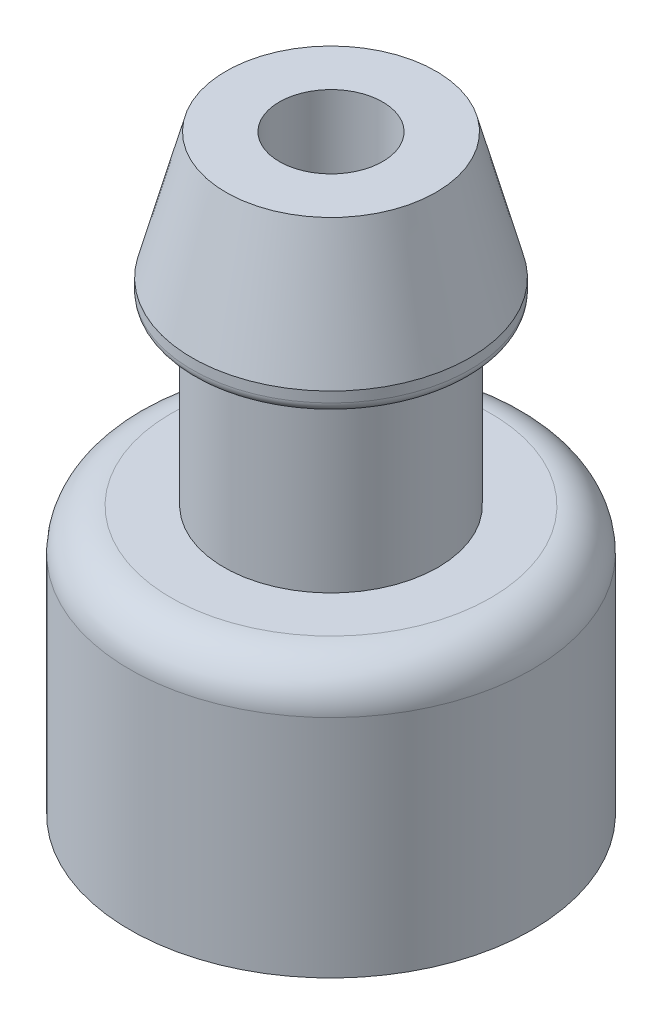
ISO-10303-21;
HEADER;
FILE_DESCRIPTION(('STEP AP214'),'2;1');
FILE_NAME('part.step','',(''),(''),'','','');
FILE_SCHEMA(('AUTOMOTIVE_DESIGN { 1 0 10303 214 1 1 1 1 }'));
ENDSEC;
DATA;
#1=APPLICATION_CONTEXT('core data for automotive mechanical design processes');
#2=APPLICATION_PROTOCOL_DEFINITION('international standard','automotive_design',2000,#1);
#3=PRODUCT_CONTEXT('',#1,'mechanical');
#4=PRODUCT('Part','Part','',(#3));
#5=PRODUCT_RELATED_PRODUCT_CATEGORY('part','',(#4));
#6=PRODUCT_DEFINITION_FORMATION('','',#4);
#7=PRODUCT_DEFINITION_CONTEXT('part definition',#1,'design');
#8=PRODUCT_DEFINITION('design','',#6,#7);
#9=PRODUCT_DEFINITION_SHAPE('','',#8);
#10=(LENGTH_UNIT() NAMED_UNIT(*) SI_UNIT(.MILLI.,.METRE.));
#11=(NAMED_UNIT(*) PLANE_ANGLE_UNIT() SI_UNIT($,.RADIAN.));
#12=(NAMED_UNIT(*) SI_UNIT($,.STERADIAN.) SOLID_ANGLE_UNIT());
#13=UNCERTAINTY_MEASURE_WITH_UNIT(LENGTH_MEASURE(1.E-05),#10,'distance_accuracy_value','');
#14=(GEOMETRIC_REPRESENTATION_CONTEXT(3) GLOBAL_UNCERTAINTY_ASSIGNED_CONTEXT((#13)) GLOBAL_UNIT_ASSIGNED_CONTEXT((#10,
#11,#12)) REPRESENTATION_CONTEXT('',''));
#15=CARTESIAN_POINT('',(0.,0.,0.));
#16=DIRECTION('',(0.,0.,1.));
#17=DIRECTION('',(1.,0.,0.));
#18=AXIS2_PLACEMENT_3D('',#15,#16,#17);
#19=CARTESIAN_POINT('',(2.5,25.1953317633222,0.));
#20=DIRECTION('',(0.,1.,0.));
#21=DIRECTION('',(-1.,0.,0.));
#22=AXIS2_PLACEMENT_3D('',#19,#20,#21);
#23=PLANE('',#22);
#24=CARTESIAN_POINT('',(0.,25.1953317633222,0.));
#25=DIRECTION('',(0.,1.,0.));
#26=DIRECTION('',(-1.,0.,0.));
#27=AXIS2_PLACEMENT_3D('',#24,#25,#26);
#28=CIRCLE('',#27,2.49999999999999);
#29=CARTESIAN_POINT('',(-2.49999999999998,25.1953317633222,0.));
#30=VERTEX_POINT('',#29);
#31=EDGE_CURVE('E157',#30,#30,#28,.F.);
#32=ORIENTED_EDGE('',*,*,#31,.T.);
#33=EDGE_LOOP('',(#32));
#34=FACE_BOUND('',#33,.T.);
#35=CARTESIAN_POINT('',(0.,25.1953317632569,0.));
#36=DIRECTION('',(0.,-1.,0.));
#37=DIRECTION('',(1.,0.,0.));
#38=AXIS2_PLACEMENT_3D('',#35,#36,#37);
#39=CIRCLE('',#38,5.07999999999447);
#40=CARTESIAN_POINT('',(5.07999999999449,25.1953317632569,0.));
#41=VERTEX_POINT('',#40);
#42=EDGE_CURVE('E172',#41,#41,#39,.T.);
#43=ORIENTED_EDGE('',*,*,#42,.F.);
#44=EDGE_LOOP('',(#43));
#45=FACE_BOUND('',#44,.T.);
#46=ADVANCED_FACE('F17',(#34,#45),#23,.T.);
#47=CARTESIAN_POINT('',(0.,19.0833317633974,0.));
#48=DIRECTION('',(0.,-1.,0.));
#49=DIRECTION('',(1.,0.,0.));
#50=AXIS2_PLACEMENT_3D('',#47,#48,#49);
#51=CONICAL_SURFACE('',#50,6.71887128058301,0.261977344231248);
#52=ORIENTED_EDGE('',*,*,#42,.T.);
#53=EDGE_LOOP('',(#52));
#54=FACE_BOUND('',#53,.T.);
#55=CARTESIAN_POINT('',(0.,19.0833317633222,0.));
#56=DIRECTION('',(0.,1.,0.));
#57=DIRECTION('',(-1.,0.,0.));
#58=AXIS2_PLACEMENT_3D('',#55,#56,#57);
#59=CIRCLE('',#58,6.71887128061717);
#60=CARTESIAN_POINT('',(-6.71887128061716,19.0833317633222,0.));
#61=VERTEX_POINT('',#60);
#62=EDGE_CURVE('E154',#61,#61,#59,.F.);
#63=ORIENTED_EDGE('',*,*,#62,.F.);
#64=EDGE_LOOP('',(#63));
#65=FACE_BOUND('',#64,.T.);
#66=ADVANCED_FACE('F298',(#54,#65),#51,.T.);
#67=CARTESIAN_POINT('',(0.,0.,0.));
#68=DIRECTION('',(0.,1.,0.));
#69=DIRECTION('',(-1.,0.,0.));
#70=AXIS2_PLACEMENT_3D('',#67,#68,#69);
#71=CYLINDRICAL_SURFACE('',#70,2.49999999999999);
#72=ORIENTED_EDGE('',*,*,#31,.F.);
#73=EDGE_LOOP('',(#72));
#74=FACE_BOUND('',#73,.T.);
#75=CARTESIAN_POINT('',(0.,7.53433182332216,0.));
#76=DIRECTION('',(0.,1.,0.));
#77=DIRECTION('',(-1.,0.,0.));
#78=AXIS2_PLACEMENT_3D('',#75,#76,#77);
#79=CIRCLE('',#78,2.49999999999999);
#80=CARTESIAN_POINT('',(-2.49999999999999,7.53433182332216,0.));
#81=VERTEX_POINT('',#80);
#82=EDGE_CURVE('E153',#81,#81,#79,.T.);
#83=ORIENTED_EDGE('',*,*,#82,.F.);
#84=EDGE_LOOP('',(#83));
#85=FACE_BOUND('',#84,.T.);
#86=ADVANCED_FACE('F296',(#74,#85),#71,.F.);
#87=CARTESIAN_POINT('',(0.,0.,0.));
#88=DIRECTION('',(0.,1.,0.));
#89=DIRECTION('',(-1.,0.,0.));
#90=AXIS2_PLACEMENT_3D('',#87,#88,#89);
#91=CYLINDRICAL_SURFACE('',#90,6.71887128061717);
#92=CARTESIAN_POINT('',(0.,18.5833317633222,0.));
#93=DIRECTION('',(0.,1.,0.));
#94=DIRECTION('',(-1.,0.,0.));
#95=AXIS2_PLACEMENT_3D('',#92,#93,#94);
#96=CIRCLE('',#95,6.71887128061717);
#97=CARTESIAN_POINT('',(-6.71887128061716,18.5833317633222,0.));
#98=VERTEX_POINT('',#97);
#99=EDGE_CURVE('E144',#98,#98,#96,.F.);
#100=ORIENTED_EDGE('',*,*,#99,.F.);
#101=EDGE_LOOP('',(#100));
#102=FACE_BOUND('',#101,.T.);
#103=ORIENTED_EDGE('',*,*,#62,.T.);
#104=EDGE_LOOP('',(#103));
#105=FACE_BOUND('',#104,.T.);
#106=ADVANCED_FACE('F129',(#102,#105),#91,.T.);
#107=CARTESIAN_POINT('',(5.65,7.53433182332216,0.));
#108=DIRECTION('',(0.,-1.,0.));
#109=DIRECTION('',(1.,0.,0.));
#110=AXIS2_PLACEMENT_3D('',#107,#108,#109);
#111=PLANE('',#110);
#112=CARTESIAN_POINT('',(0.,7.53433182332216,0.));
#113=DIRECTION('',(0.,1.,0.));
#114=DIRECTION('',(-1.,0.,0.));
#115=AXIS2_PLACEMENT_3D('',#112,#113,#114);
#116=CIRCLE('',#115,5.65);
#117=CARTESIAN_POINT('',(5.65,7.53433182332216,0.));
#118=VERTEX_POINT('',#117);
#119=CARTESIAN_POINT('',(-5.64999999999999,7.53433182332216,0.));
#120=VERTEX_POINT('',#119);
#121=EDGE_CURVE('E65',#118,#120,#116,.F.);
#122=ORIENTED_EDGE('',*,*,#121,.T.);
#123=CARTESIAN_POINT('',(0.,7.53433182332216,0.));
#124=DIRECTION('',(0.,1.,0.));
#125=DIRECTION('',(1.,0.,0.));
#126=AXIS2_PLACEMENT_3D('',#123,#124,#125);
#127=CIRCLE('',#126,5.65);
#128=EDGE_CURVE('E152',#120,#118,#127,.F.);
#129=ORIENTED_EDGE('',*,*,#128,.T.);
#130=EDGE_LOOP('',(#122,#129));
#131=FACE_BOUND('',#130,.T.);
#132=ORIENTED_EDGE('',*,*,#82,.T.);
#133=EDGE_LOOP('',(#132));
#134=FACE_BOUND('',#133,.T.);
#135=ADVANCED_FACE('F120',(#131,#134),#111,.T.);
#136=CARTESIAN_POINT('',(0.,18.5833317633222,0.));
#137=DIRECTION('',(0.,1.,0.));
#138=DIRECTION('',(-1.,0.,0.));
#139=AXIS2_PLACEMENT_3D('',#136,#137,#138);
#140=TOROIDAL_SURFACE('',#139,6.21887128061717,0.500000000000001);
#141=CARTESIAN_POINT('',(0.,18.0833317633222,0.));
#142=DIRECTION('',(0.,1.,0.));
#143=DIRECTION('',(-1.,0.,0.));
#144=AXIS2_PLACEMENT_3D('',#141,#142,#143);
#145=CIRCLE('',#144,6.21887128061717);
#146=CARTESIAN_POINT('',(6.21887128061718,18.0833317633222,0.));
#147=VERTEX_POINT('',#146);
#148=CARTESIAN_POINT('',(-6.21887128061716,18.0833317633222,0.));
#149=VERTEX_POINT('',#148);
#150=EDGE_CURVE('E60',#147,#149,#145,.F.);
#151=ORIENTED_EDGE('',*,*,#150,.F.);
#152=CARTESIAN_POINT('',(0.,18.0833317633222,0.));
#153=DIRECTION('',(0.,1.,0.));
#154=DIRECTION('',(1.,0.,0.));
#155=AXIS2_PLACEMENT_3D('',#152,#153,#154);
#156=CIRCLE('',#155,6.21887128061717);
#157=EDGE_CURVE('E57',#149,#147,#156,.F.);
#158=ORIENTED_EDGE('',*,*,#157,.F.);
#159=EDGE_LOOP('',(#151,#158));
#160=FACE_BOUND('',#159,.T.);
#161=ORIENTED_EDGE('',*,*,#99,.T.);
#162=EDGE_LOOP('',(#161));
#163=FACE_BOUND('',#162,.T.);
#164=ADVANCED_FACE('F61',(#160,#163),#140,.T.);
#165=CARTESIAN_POINT('',(0.,7.03433182332216,0.));
#166=DIRECTION('',(0.,1.,0.));
#167=DIRECTION('',(-1.,0.,0.));
#168=AXIS2_PLACEMENT_3D('',#165,#166,#167);
#169=TOROIDAL_SURFACE('',#168,5.65,0.500000000000001);
#170=CARTESIAN_POINT('',(0.,7.03433182332216,0.));
#171=DIRECTION('',(0.,1.,0.));
#172=DIRECTION('',(-1.,0.,0.));
#173=AXIS2_PLACEMENT_3D('',#170,#171,#172);
#174=CIRCLE('',#173,6.15);
#175=CARTESIAN_POINT('',(-6.15,7.03433182332216,0.));
#176=VERTEX_POINT('',#175);
#177=EDGE_CURVE('E70',#176,#176,#174,.F.);
#178=ORIENTED_EDGE('',*,*,#177,.T.);
#179=EDGE_LOOP('',(#178));
#180=FACE_BOUND('',#179,.T.);
#181=ORIENTED_EDGE('',*,*,#128,.F.);
#182=ORIENTED_EDGE('',*,*,#121,.F.);
#183=EDGE_LOOP('',(#181,#182));
#184=FACE_BOUND('',#183,.T.);
#185=ADVANCED_FACE('F90',(#180,#184),#169,.F.);
#186=CARTESIAN_POINT('',(6.21887128061718,18.0833317633222,0.));
#187=DIRECTION('',(0.,-1.,0.));
#188=DIRECTION('',(1.,0.,0.));
#189=AXIS2_PLACEMENT_3D('',#186,#187,#188);
#190=PLANE('',#189);
#191=ORIENTED_EDGE('',*,*,#150,.T.);
#192=ORIENTED_EDGE('',*,*,#157,.T.);
#193=EDGE_LOOP('',(#191,#192));
#194=FACE_BOUND('',#193,.T.);
#195=CARTESIAN_POINT('',(0.,18.0833317633222,0.));
#196=DIRECTION('',(0.,1.,0.));
#197=DIRECTION('',(-1.,0.,0.));
#198=AXIS2_PLACEMENT_3D('',#195,#196,#197);
#199=CIRCLE('',#198,5.17499999999999);
#200=CARTESIAN_POINT('',(-5.17499999999998,18.0833317633222,0.));
#201=VERTEX_POINT('',#200);
#202=EDGE_CURVE('E165',#201,#201,#199,.F.);
#203=ORIENTED_EDGE('',*,*,#202,.F.);
#204=EDGE_LOOP('',(#203));
#205=FACE_BOUND('',#204,.T.);
#206=ADVANCED_FACE('F68',(#194,#205),#190,.T.);
#207=CARTESIAN_POINT('',(0.,0.,0.));
#208=DIRECTION('',(0.,1.,0.));
#209=DIRECTION('',(-1.,0.,0.));
#210=AXIS2_PLACEMENT_3D('',#207,#208,#209);
#211=CYLINDRICAL_SURFACE('',#210,6.15);
#212=CARTESIAN_POINT('',(0.,-0.833668176677837,0.));
#213=DIRECTION('',(0.,-1.,0.));
#214=DIRECTION('',(1.,0.,0.));
#215=AXIS2_PLACEMENT_3D('',#212,#213,#214);
#216=CIRCLE('',#215,6.15);
#217=CARTESIAN_POINT('',(6.15,-0.83366817667784,0.));
#218=VERTEX_POINT('',#217);
#219=EDGE_CURVE('E164',#218,#218,#216,.F.);
#220=ORIENTED_EDGE('',*,*,#219,.F.);
#221=EDGE_LOOP('',(#220));
#222=FACE_BOUND('',#221,.T.);
#223=ORIENTED_EDGE('',*,*,#177,.F.);
#224=EDGE_LOOP('',(#223));
#225=FACE_BOUND('',#224,.T.);
#226=ADVANCED_FACE('F89',(#222,#225),#211,.F.);
#227=CARTESIAN_POINT('',(0.,0.,0.));
#228=DIRECTION('',(0.,1.,0.));
#229=DIRECTION('',(-1.,0.,0.));
#230=AXIS2_PLACEMENT_3D('',#227,#228,#229);
#231=CYLINDRICAL_SURFACE('',#230,5.17499999999999);
#232=CARTESIAN_POINT('',(0.,9.53433182332216,0.));
#233=DIRECTION('',(0.,1.,0.));
#234=DIRECTION('',(-1.,0.,0.));
#235=AXIS2_PLACEMENT_3D('',#232,#233,#234);
#236=CIRCLE('',#235,5.17499999999999);
#237=CARTESIAN_POINT('',(-5.17499999999999,9.53433182332216,0.));
#238=VERTEX_POINT('',#237);
#239=EDGE_CURVE('E161',#238,#238,#236,.F.);
#240=ORIENTED_EDGE('',*,*,#239,.F.);
#241=EDGE_LOOP('',(#240));
#242=FACE_BOUND('',#241,.T.);
#243=ORIENTED_EDGE('',*,*,#202,.T.);
#244=EDGE_LOOP('',(#243));
#245=FACE_BOUND('',#244,.T.);
#246=ADVANCED_FACE('F275',(#242,#245),#231,.T.);
#247=CARTESIAN_POINT('',(0.,-0.833668176677836,0.));
#248=DIRECTION('',(0.,-1.,0.));
#249=DIRECTION('',(1.,0.,0.));
#250=AXIS2_PLACEMENT_3D('',#247,#248,#249);
#251=TOROIDAL_SURFACE('',#250,8.69,2.54);
#252=ORIENTED_EDGE('',*,*,#219,.T.);
#253=EDGE_LOOP('',(#252));
#254=FACE_BOUND('',#253,.T.);
#255=CARTESIAN_POINT('',(0.,-3.37366817667784,0.));
#256=DIRECTION('',(0.,-1.,0.));
#257=DIRECTION('',(1.,0.,0.));
#258=AXIS2_PLACEMENT_3D('',#255,#256,#257);
#259=CIRCLE('',#258,8.69);
#260=CARTESIAN_POINT('',(-8.69,-3.37366817667783,0.));
#261=VERTEX_POINT('',#260);
#262=CARTESIAN_POINT('',(8.69,-3.37366817667784,0.));
#263=VERTEX_POINT('',#262);
#264=EDGE_CURVE('E215',#261,#263,#259,.F.);
#265=ORIENTED_EDGE('',*,*,#264,.F.);
#266=CARTESIAN_POINT('',(0.,-3.37366817667784,0.));
#267=DIRECTION('',(0.,-1.,0.));
#268=DIRECTION('',(-1.,0.,0.));
#269=AXIS2_PLACEMENT_3D('',#266,#267,#268);
#270=CIRCLE('',#269,8.69);
#271=EDGE_CURVE('E205',#263,#261,#270,.F.);
#272=ORIENTED_EDGE('',*,*,#271,.F.);
#273=EDGE_LOOP('',(#265,#272));
#274=FACE_BOUND('',#273,.T.);
#275=ADVANCED_FACE('F237',(#254,#274),#251,.T.);
#276=CARTESIAN_POINT('',(5.175,9.53433182332216,0.));
#277=DIRECTION('',(0.,1.,0.));
#278=DIRECTION('',(-1.,0.,0.));
#279=AXIS2_PLACEMENT_3D('',#276,#277,#278);
#280=PLANE('',#279);
#281=ORIENTED_EDGE('',*,*,#239,.T.);
#282=EDGE_LOOP('',(#281));
#283=FACE_BOUND('',#282,.T.);
#284=CARTESIAN_POINT('',(0.,9.53433182332216,0.));
#285=DIRECTION('',(0.,-1.,0.));
#286=DIRECTION('',(1.,0.,0.));
#287=AXIS2_PLACEMENT_3D('',#284,#285,#286);
#288=CIRCLE('',#287,7.72819999999999);
#289=CARTESIAN_POINT('',(7.7282,9.53433182332216,0.));
#290=VERTEX_POINT('',#289);
#291=CARTESIAN_POINT('',(-7.72819999999999,9.53433182332216,0.));
#292=VERTEX_POINT('',#291);
#293=EDGE_CURVE('E160',#290,#292,#288,.T.);
#294=ORIENTED_EDGE('',*,*,#293,.F.);
#295=CARTESIAN_POINT('',(0.,9.53433182332216,0.));
#296=DIRECTION('',(0.,-1.,0.));
#297=DIRECTION('',(-1.,0.,0.));
#298=AXIS2_PLACEMENT_3D('',#295,#296,#297);
#299=CIRCLE('',#298,7.72819999999999);
#300=EDGE_CURVE('E36',#292,#290,#299,.T.);
#301=ORIENTED_EDGE('',*,*,#300,.F.);
#302=EDGE_LOOP('',(#294,#301));
#303=FACE_BOUND('',#302,.T.);
#304=ADVANCED_FACE('F228',(#283,#303),#280,.T.);
#305=CARTESIAN_POINT('',(9.72819999999999,-3.37366817667784,0.));
#306=DIRECTION('',(0.,-1.,0.));
#307=DIRECTION('',(1.,0.,0.));
#308=AXIS2_PLACEMENT_3D('',#305,#306,#307);
#309=PLANE('',#308);
#310=CARTESIAN_POINT('',(0.,-3.37366817667784,0.));
#311=DIRECTION('',(0.,1.,0.));
#312=DIRECTION('',(-1.,0.,0.));
#313=AXIS2_PLACEMENT_3D('',#310,#311,#312);
#314=CIRCLE('',#313,9.7282);
#315=CARTESIAN_POINT('',(-9.7282,-3.37366817667783,0.));
#316=VERTEX_POINT('',#315);
#317=EDGE_CURVE('E28',#316,#316,#314,.T.);
#318=ORIENTED_EDGE('',*,*,#317,.F.);
#319=EDGE_LOOP('',(#318));
#320=FACE_BOUND('',#319,.T.);
#321=ORIENTED_EDGE('',*,*,#271,.T.);
#322=ORIENTED_EDGE('',*,*,#264,.T.);
#323=EDGE_LOOP('',(#321,#322));
#324=FACE_BOUND('',#323,.T.);
#325=ADVANCED_FACE('F194',(#320,#324),#309,.T.);
#326=CARTESIAN_POINT('',(0.,7.53433182332216,0.));
#327=DIRECTION('',(0.,1.,0.));
#328=DIRECTION('',(-1.,0.,0.));
#329=AXIS2_PLACEMENT_3D('',#326,#327,#328);
#330=TOROIDAL_SURFACE('',#329,7.72819999999999,2.);
#331=ORIENTED_EDGE('',*,*,#300,.T.);
#332=ORIENTED_EDGE('',*,*,#293,.T.);
#333=EDGE_LOOP('',(#331,#332));
#334=FACE_BOUND('',#333,.T.);
#335=CARTESIAN_POINT('',(0.,7.53433182332216,0.));
#336=DIRECTION('',(0.,1.,0.));
#337=DIRECTION('',(-1.,0.,0.));
#338=AXIS2_PLACEMENT_3D('',#335,#336,#337);
#339=CIRCLE('',#338,9.7282);
#340=CARTESIAN_POINT('',(-9.72819999999999,7.53433182332217,0.));
#341=VERTEX_POINT('',#340);
#342=EDGE_CURVE('E11',#341,#341,#339,.F.);
#343=ORIENTED_EDGE('',*,*,#342,.F.);
#344=EDGE_LOOP('',(#343));
#345=FACE_BOUND('',#344,.T.);
#346=ADVANCED_FACE('F182',(#334,#345),#330,.T.);
#347=CARTESIAN_POINT('',(0.,0.,0.));
#348=DIRECTION('',(0.,1.,0.));
#349=DIRECTION('',(-1.,0.,0.));
#350=AXIS2_PLACEMENT_3D('',#347,#348,#349);
#351=CYLINDRICAL_SURFACE('',#350,9.7282);
#352=ORIENTED_EDGE('',*,*,#342,.T.);
#353=EDGE_LOOP('',(#352));
#354=FACE_BOUND('',#353,.T.);
#355=ORIENTED_EDGE('',*,*,#317,.T.);
#356=EDGE_LOOP('',(#355));
#357=FACE_BOUND('',#356,.T.);
#358=ADVANCED_FACE('F193',(#354,#357),#351,.T.);
#359=CLOSED_SHELL('',(#46,#66,#86,#106,#135,#164,#185,#206,#226,#246,#275,#304,#325,#346,#358));
#360=MANIFOLD_SOLID_BREP('B1',#359);
#361=ADVANCED_BREP_SHAPE_REPRESENTATION('',(#18,#360),#14);
#362=SHAPE_DEFINITION_REPRESENTATION(#9,#361);
ENDSEC;
END-ISO-10303-21;
